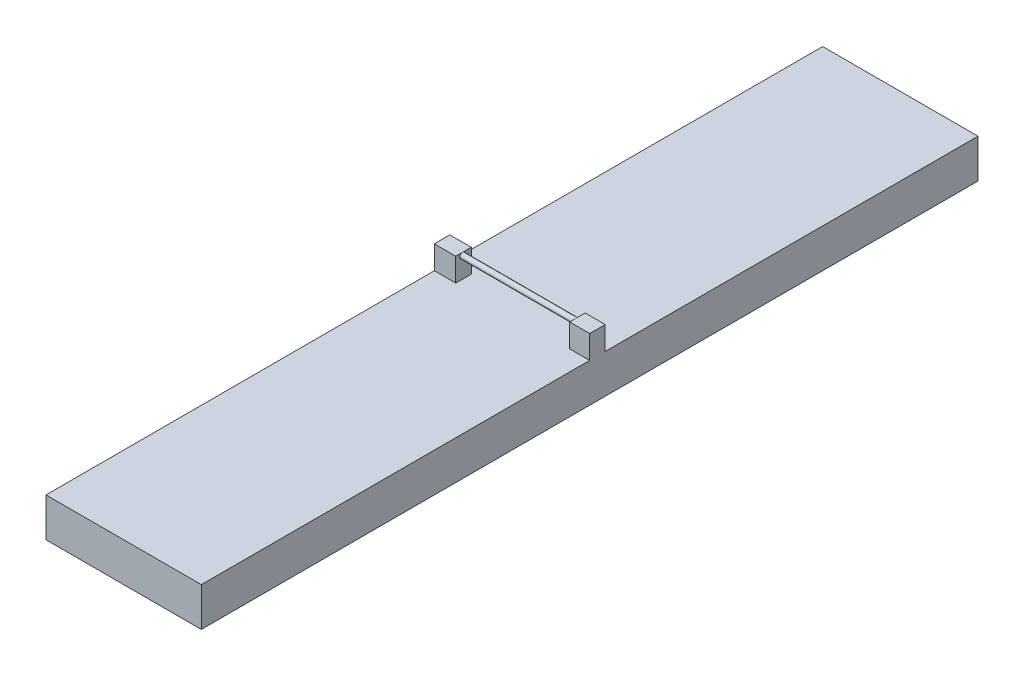
ISO-10303-21;
HEADER;
FILE_DESCRIPTION(('STEP AP214'),'2;1');
FILE_NAME('part.step','',(''),(''),'','','');
FILE_SCHEMA(('AUTOMOTIVE_DESIGN { 1 0 10303 214 1 1 1 1 }'));
ENDSEC;
DATA;
#1=APPLICATION_CONTEXT('core data for automotive mechanical design processes');
#2=APPLICATION_PROTOCOL_DEFINITION('international standard','automotive_design',2000,#1);
#3=PRODUCT_CONTEXT('',#1,'mechanical');
#4=PRODUCT('Part','Part','',(#3));
#5=PRODUCT_RELATED_PRODUCT_CATEGORY('part','',(#4));
#6=PRODUCT_DEFINITION_FORMATION('','',#4);
#7=PRODUCT_DEFINITION_CONTEXT('part definition',#1,'design');
#8=PRODUCT_DEFINITION('design','',#6,#7);
#9=PRODUCT_DEFINITION_SHAPE('','',#8);
#10=(LENGTH_UNIT() NAMED_UNIT(*) SI_UNIT(.MILLI.,.METRE.));
#11=(NAMED_UNIT(*) PLANE_ANGLE_UNIT() SI_UNIT($,.RADIAN.));
#12=(NAMED_UNIT(*) SI_UNIT($,.STERADIAN.) SOLID_ANGLE_UNIT());
#13=UNCERTAINTY_MEASURE_WITH_UNIT(LENGTH_MEASURE(1.E-05),#10,'distance_accuracy_value','');
#14=(GEOMETRIC_REPRESENTATION_CONTEXT(3) GLOBAL_UNCERTAINTY_ASSIGNED_CONTEXT((#13)) GLOBAL_UNIT_ASSIGNED_CONTEXT((#10,
#11,#12)) REPRESENTATION_CONTEXT('',''));
#15=CARTESIAN_POINT('',(0.,0.,0.));
#16=DIRECTION('',(0.,0.,1.));
#17=DIRECTION('',(1.,0.,0.));
#18=AXIS2_PLACEMENT_3D('',#15,#16,#17);
#19=CARTESIAN_POINT('',(-100.,38.6000003153697,-950.));
#20=DIRECTION('',(0.,0.,-1.));
#21=DIRECTION('',(-1.,0.,0.));
#22=AXIS2_PLACEMENT_3D('',#19,#20,#21);
#23=PLANE('',#22);
#24=DIRECTION('',(1.,0.,0.));
#25=VECTOR('',#24,1.);
#26=CARTESIAN_POINT('',(-100.,38.6000003153697,-950.));
#27=LINE('',#26,#25);
#28=CARTESIAN_POINT('',(-100.,38.6000003153697,-950.));
#29=VERTEX_POINT('',#28);
#30=CARTESIAN_POINT('',(100.,38.6000003153697,-950.));
#31=VERTEX_POINT('',#30);
#32=EDGE_CURVE('E35',#29,#31,#27,.T.);
#33=ORIENTED_EDGE('',*,*,#32,.T.);
#34=DIRECTION('',(0.,1.,0.));
#35=VECTOR('',#34,1.);
#36=CARTESIAN_POINT('',(100.,38.6000003153697,-950.));
#37=LINE('',#36,#35);
#38=CARTESIAN_POINT('',(100.,-11.3999996846303,-950.));
#39=VERTEX_POINT('',#38);
#40=EDGE_CURVE('E198',#39,#31,#37,.T.);
#41=ORIENTED_EDGE('',*,*,#40,.F.);
#42=DIRECTION('',(1.,0.,0.));
#43=VECTOR('',#42,1.);
#44=CARTESIAN_POINT('',(-100.,-11.3999996846303,-950.));
#45=LINE('',#44,#43);
#46=CARTESIAN_POINT('',(-100.,-11.3999996846303,-950.));
#47=VERTEX_POINT('',#46);
#48=EDGE_CURVE('E11',#47,#39,#45,.T.);
#49=ORIENTED_EDGE('',*,*,#48,.F.);
#50=DIRECTION('',(0.,1.,0.));
#51=VECTOR('',#50,1.);
#52=CARTESIAN_POINT('',(-100.,38.6000003153697,-950.));
#53=LINE('',#52,#51);
#54=EDGE_CURVE('E211',#47,#29,#53,.T.);
#55=ORIENTED_EDGE('',*,*,#54,.T.);
#56=EDGE_LOOP('',(#33,#41,#49,#55));
#57=FACE_BOUND('',#56,.T.);
#58=ADVANCED_FACE('F32',(#57),#23,.T.);
#59=CARTESIAN_POINT('',(-100.,-11.3999996846303,50.));
#60=DIRECTION('',(0.,-1.,0.));
#61=DIRECTION('',(0.,0.,-1.));
#62=AXIS2_PLACEMENT_3D('',#59,#60,#61);
#63=PLANE('',#62);
#64=ORIENTED_EDGE('',*,*,#48,.T.);
#65=DIRECTION('',(0.,0.,-1.));
#66=VECTOR('',#65,1.);
#67=CARTESIAN_POINT('',(100.,-11.3999996846303,50.));
#68=LINE('',#67,#66);
#69=CARTESIAN_POINT('',(100.,-11.3999996846303,50.));
#70=VERTEX_POINT('',#69);
#71=EDGE_CURVE('E208',#70,#39,#68,.T.);
#72=ORIENTED_EDGE('',*,*,#71,.F.);
#73=DIRECTION('',(1.,0.,0.));
#74=VECTOR('',#73,1.);
#75=CARTESIAN_POINT('',(-100.,-11.3999996846303,50.));
#76=LINE('',#75,#74);
#77=CARTESIAN_POINT('',(-100.,-11.3999996846303,50.));
#78=VERTEX_POINT('',#77);
#79=EDGE_CURVE('E40',#78,#70,#76,.T.);
#80=ORIENTED_EDGE('',*,*,#79,.F.);
#81=DIRECTION('',(0.,0.,-1.));
#82=VECTOR('',#81,1.);
#83=CARTESIAN_POINT('',(-100.,-11.3999996846303,50.));
#84=LINE('',#83,#82);
#85=EDGE_CURVE('E220',#78,#47,#84,.T.);
#86=ORIENTED_EDGE('',*,*,#85,.T.);
#87=EDGE_LOOP('',(#64,#72,#80,#86));
#88=FACE_BOUND('',#87,.T.);
#89=ADVANCED_FACE('F239',(#88),#63,.T.);
#90=CARTESIAN_POINT('',(-100.,38.6000003153697,50.));
#91=DIRECTION('',(0.,0.,1.));
#92=DIRECTION('',(0.,-1.,0.));
#93=AXIS2_PLACEMENT_3D('',#90,#91,#92);
#94=PLANE('',#93);
#95=ORIENTED_EDGE('',*,*,#79,.T.);
#96=DIRECTION('',(0.,-1.,0.));
#97=VECTOR('',#96,1.);
#98=CARTESIAN_POINT('',(100.,38.6000003153697,50.));
#99=LINE('',#98,#97);
#100=CARTESIAN_POINT('',(100.,38.6000003153697,50.));
#101=VERTEX_POINT('',#100);
#102=EDGE_CURVE('E205',#101,#70,#99,.T.);
#103=ORIENTED_EDGE('',*,*,#102,.F.);
#104=DIRECTION('',(1.,0.,0.));
#105=VECTOR('',#104,1.);
#106=CARTESIAN_POINT('',(-100.,38.6000003153697,50.));
#107=LINE('',#106,#105);
#108=CARTESIAN_POINT('',(-100.,38.6000003153697,50.));
#109=VERTEX_POINT('',#108);
#110=EDGE_CURVE('E223',#109,#101,#107,.T.);
#111=ORIENTED_EDGE('',*,*,#110,.F.);
#112=DIRECTION('',(0.,-1.,0.));
#113=VECTOR('',#112,1.);
#114=CARTESIAN_POINT('',(-100.,38.6000003153697,50.));
#115=LINE('',#114,#113);
#116=EDGE_CURVE('E217',#109,#78,#115,.T.);
#117=ORIENTED_EDGE('',*,*,#116,.T.);
#118=EDGE_LOOP('',(#95,#103,#111,#117));
#119=FACE_BOUND('',#118,.T.);
#120=ADVANCED_FACE('F260',(#119),#94,.T.);
#121=CARTESIAN_POINT('',(-100.,38.6000003153697,50.));
#122=DIRECTION('',(0.,1.,0.));
#123=DIRECTION('',(0.,0.,1.));
#124=AXIS2_PLACEMENT_3D('',#121,#122,#123);
#125=PLANE('',#124);
#126=DIRECTION('',(1.,0.,0.));
#127=VECTOR('',#126,1.);
#128=CARTESIAN_POINT('',(0.,38.6000003153697,-470.));
#129=LINE('',#128,#127);
#130=CARTESIAN_POINT('',(74.235459600402,38.6000003153697,-470.));
#131=VERTEX_POINT('',#130);
#132=CARTESIAN_POINT('',(100.,38.6000003153697,-470.));
#133=VERTEX_POINT('',#132);
#134=EDGE_CURVE('E131',#131,#133,#129,.T.);
#135=ORIENTED_EDGE('',*,*,#134,.T.);
#136=DIRECTION('',(0.,0.,1.));
#137=VECTOR('',#136,1.);
#138=CARTESIAN_POINT('',(100.,38.6000003153697,50.));
#139=LINE('',#138,#137);
#140=EDGE_CURVE('E202',#31,#133,#139,.T.);
#141=ORIENTED_EDGE('',*,*,#140,.F.);
#142=ORIENTED_EDGE('',*,*,#32,.F.);
#143=DIRECTION('',(0.,0.,1.));
#144=VECTOR('',#143,1.);
#145=CARTESIAN_POINT('',(-100.,38.6000003153697,50.));
#146=LINE('',#145,#144);
#147=CARTESIAN_POINT('',(-100.,38.6000003153697,-470.));
#148=VERTEX_POINT('',#147);
#149=EDGE_CURVE('E215',#29,#148,#146,.T.);
#150=ORIENTED_EDGE('',*,*,#149,.T.);
#151=DIRECTION('',(1.,0.,0.));
#152=VECTOR('',#151,1.);
#153=CARTESIAN_POINT('',(0.,38.6000003153697,-470.));
#154=LINE('',#153,#152);
#155=CARTESIAN_POINT('',(-72.4508751216035,38.6000003153697,-470.));
#156=VERTEX_POINT('',#155);
#157=EDGE_CURVE('E171',#148,#156,#154,.T.);
#158=ORIENTED_EDGE('',*,*,#157,.T.);
#159=DIRECTION('',(0.,0.,-1.));
#160=VECTOR('',#159,1.);
#161=CARTESIAN_POINT('',(-72.4508751216035,38.6000003153697,0.));
#162=LINE('',#161,#160);
#163=CARTESIAN_POINT('',(-72.4508751216035,38.6000003153697,-450.));
#164=VERTEX_POINT('',#163);
#165=EDGE_CURVE('E183',#164,#156,#162,.T.);
#166=ORIENTED_EDGE('',*,*,#165,.F.);
#167=DIRECTION('',(1.,0.,0.));
#168=VECTOR('',#167,1.);
#169=CARTESIAN_POINT('',(0.,38.6000003153697,-450.));
#170=LINE('',#169,#168);
#171=CARTESIAN_POINT('',(-100.,38.6000003153697,-450.));
#172=VERTEX_POINT('',#171);
#173=EDGE_CURVE('E134',#172,#164,#170,.T.);
#174=ORIENTED_EDGE('',*,*,#173,.F.);
#175=EDGE_CURVE('E214',#172,#109,#146,.T.);
#176=ORIENTED_EDGE('',*,*,#175,.T.);
#177=ORIENTED_EDGE('',*,*,#110,.T.);
#178=CARTESIAN_POINT('',(100.,38.6000003153697,-450.));
#179=VERTEX_POINT('',#178);
#180=EDGE_CURVE('E201',#179,#101,#139,.T.);
#181=ORIENTED_EDGE('',*,*,#180,.F.);
#182=DIRECTION('',(1.,0.,0.));
#183=VECTOR('',#182,1.);
#184=CARTESIAN_POINT('',(0.,38.6000003153697,-450.));
#185=LINE('',#184,#183);
#186=CARTESIAN_POINT('',(74.235459600402,38.6000003153697,-450.));
#187=VERTEX_POINT('',#186);
#188=EDGE_CURVE('E149',#187,#179,#185,.T.);
#189=ORIENTED_EDGE('',*,*,#188,.F.);
#190=DIRECTION('',(0.,0.,1.));
#191=VECTOR('',#190,1.);
#192=CARTESIAN_POINT('',(74.235459600402,38.6000003153697,0.));
#193=LINE('',#192,#191);
#194=EDGE_CURVE('E152',#131,#187,#193,.T.);
#195=ORIENTED_EDGE('',*,*,#194,.F.);
#196=EDGE_LOOP('',(#135,#141,#142,#150,#158,#166,#174,#176,#177,#181,#189,#195));
#197=FACE_BOUND('',#196,.T.);
#198=ADVANCED_FACE('F234',(#197),#125,.T.);
#199=CARTESIAN_POINT('',(-100.,0.,0.));
#200=DIRECTION('',(1.,0.,0.));
#201=DIRECTION('',(0.,0.,-1.));
#202=AXIS2_PLACEMENT_3D('',#199,#200,#201);
#203=PLANE('',#202);
#204=ORIENTED_EDGE('',*,*,#54,.F.);
#205=ORIENTED_EDGE('',*,*,#85,.F.);
#206=ORIENTED_EDGE('',*,*,#116,.F.);
#207=ORIENTED_EDGE('',*,*,#175,.F.);
#208=DIRECTION('',(0.,-1.,0.));
#209=VECTOR('',#208,1.);
#210=CARTESIAN_POINT('',(-100.,68.6000003153697,-450.));
#211=LINE('',#210,#209);
#212=CARTESIAN_POINT('',(-100.,68.6000003153697,-450.));
#213=VERTEX_POINT('',#212);
#214=EDGE_CURVE('E180',#213,#172,#211,.T.);
#215=ORIENTED_EDGE('',*,*,#214,.F.);
#216=DIRECTION('',(0.,0.,1.));
#217=VECTOR('',#216,1.);
#218=CARTESIAN_POINT('',(-100.,68.6000003153697,0.));
#219=LINE('',#218,#217);
#220=CARTESIAN_POINT('',(-100.,68.6000003153697,-470.));
#221=VERTEX_POINT('',#220);
#222=EDGE_CURVE('E178',#221,#213,#219,.T.);
#223=ORIENTED_EDGE('',*,*,#222,.F.);
#224=DIRECTION('',(0.,-1.,0.));
#225=VECTOR('',#224,1.);
#226=CARTESIAN_POINT('',(-100.,68.6000003153697,-470.));
#227=LINE('',#226,#225);
#228=EDGE_CURVE('E189',#221,#148,#227,.T.);
#229=ORIENTED_EDGE('',*,*,#228,.T.);
#230=ORIENTED_EDGE('',*,*,#149,.F.);
#231=EDGE_LOOP('',(#204,#205,#206,#207,#215,#223,#229,#230));
#232=FACE_BOUND('',#231,.T.);
#233=ADVANCED_FACE('F242',(#232),#203,.F.);
#234=CARTESIAN_POINT('',(100.,0.,0.));
#235=DIRECTION('',(1.,0.,0.));
#236=DIRECTION('',(0.,0.,-1.));
#237=AXIS2_PLACEMENT_3D('',#234,#235,#236);
#238=PLANE('',#237);
#239=ORIENTED_EDGE('',*,*,#40,.T.);
#240=ORIENTED_EDGE('',*,*,#140,.T.);
#241=DIRECTION('',(0.,-1.,0.));
#242=VECTOR('',#241,1.);
#243=CARTESIAN_POINT('',(100.,68.6000003153697,-470.));
#244=LINE('',#243,#242);
#245=CARTESIAN_POINT('',(100.,68.6000003153697,-470.));
#246=VERTEX_POINT('',#245);
#247=EDGE_CURVE('E159',#246,#133,#244,.T.);
#248=ORIENTED_EDGE('',*,*,#247,.F.);
#249=DIRECTION('',(0.,0.,-1.));
#250=VECTOR('',#249,1.);
#251=CARTESIAN_POINT('',(100.,68.6000003153697,0.));
#252=LINE('',#251,#250);
#253=CARTESIAN_POINT('',(100.,68.6000003153697,-450.));
#254=VERTEX_POINT('',#253);
#255=EDGE_CURVE('E147',#254,#246,#252,.T.);
#256=ORIENTED_EDGE('',*,*,#255,.F.);
#257=DIRECTION('',(0.,-1.,0.));
#258=VECTOR('',#257,1.);
#259=CARTESIAN_POINT('',(100.,68.6000003153697,-450.));
#260=LINE('',#259,#258);
#261=EDGE_CURVE('E163',#254,#179,#260,.T.);
#262=ORIENTED_EDGE('',*,*,#261,.T.);
#263=ORIENTED_EDGE('',*,*,#180,.T.);
#264=ORIENTED_EDGE('',*,*,#102,.T.);
#265=ORIENTED_EDGE('',*,*,#71,.T.);
#266=EDGE_LOOP('',(#239,#240,#248,#256,#262,#263,#264,#265));
#267=FACE_BOUND('',#266,.T.);
#268=ADVANCED_FACE('F236',(#267),#238,.T.);
#269=CARTESIAN_POINT('',(0.,68.6000003153697,-450.));
#270=DIRECTION('',(0.,0.,-1.));
#271=DIRECTION('',(0.,1.,0.));
#272=AXIS2_PLACEMENT_3D('',#269,#270,#271);
#273=PLANE('',#272);
#274=ORIENTED_EDGE('',*,*,#173,.T.);
#275=DIRECTION('',(0.,-1.,0.));
#276=VECTOR('',#275,1.);
#277=CARTESIAN_POINT('',(-72.4508751216035,68.6000003153697,-450.));
#278=LINE('',#277,#276);
#279=CARTESIAN_POINT('',(-72.4508751216035,68.6000003153697,-450.));
#280=VERTEX_POINT('',#279);
#281=EDGE_CURVE('E195',#280,#164,#278,.T.);
#282=ORIENTED_EDGE('',*,*,#281,.F.);
#283=DIRECTION('',(1.,0.,0.));
#284=VECTOR('',#283,1.);
#285=CARTESIAN_POINT('',(0.,68.6000003153697,-450.));
#286=LINE('',#285,#284);
#287=EDGE_CURVE('E167',#213,#280,#286,.T.);
#288=ORIENTED_EDGE('',*,*,#287,.F.);
#289=ORIENTED_EDGE('',*,*,#214,.T.);
#290=EDGE_LOOP('',(#274,#282,#288,#289));
#291=FACE_BOUND('',#290,.T.);
#292=ADVANCED_FACE('F256',(#291),#273,.F.);
#293=CARTESIAN_POINT('',(-72.4508751216035,68.6000003153697,0.));
#294=DIRECTION('',(-1.,0.,0.));
#295=DIRECTION('',(0.,0.,1.));
#296=AXIS2_PLACEMENT_3D('',#293,#294,#295);
#297=PLANE('',#296);
#298=DIRECTION('',(0.,0.,-1.));
#299=VECTOR('',#298,1.);
#300=CARTESIAN_POINT('',(-72.4508751216035,68.6000003153697,0.));
#301=LINE('',#300,#299);
#302=CARTESIAN_POINT('',(-72.4508751216035,68.6000003153697,-458.61552839436));
#303=VERTEX_POINT('',#302);
#304=CARTESIAN_POINT('',(-72.4508751216035,68.6000003153697,-470.));
#305=VERTEX_POINT('',#304);
#306=EDGE_CURVE('E170',#303,#305,#301,.T.);
#307=ORIENTED_EDGE('',*,*,#306,.F.);
#308=CARTESIAN_POINT('',(-72.4508751216035,65.1518689275737,-458.61552839436));
#309=DIRECTION('',(-1.,0.,0.));
#310=DIRECTION('',(0.,0.,1.));
#311=AXIS2_PLACEMENT_3D('',#308,#309,#310);
#312=CIRCLE('',#311,3.44813138779607);
#313=EDGE_CURVE('E46',#303,#303,#312,.T.);
#314=ORIENTED_EDGE('',*,*,#313,.T.);
#315=EDGE_CURVE('E172',#280,#303,#301,.T.);
#316=ORIENTED_EDGE('',*,*,#315,.F.);
#317=ORIENTED_EDGE('',*,*,#281,.T.);
#318=ORIENTED_EDGE('',*,*,#165,.T.);
#319=DIRECTION('',(0.,-1.,0.));
#320=VECTOR('',#319,1.);
#321=CARTESIAN_POINT('',(-72.4508751216035,68.6000003153697,-470.));
#322=LINE('',#321,#320);
#323=EDGE_CURVE('E192',#305,#156,#322,.T.);
#324=ORIENTED_EDGE('',*,*,#323,.F.);
#325=EDGE_LOOP('',(#307,#314,#316,#317,#318,#324));
#326=FACE_BOUND('',#325,.T.);
#327=ADVANCED_FACE('F252',(#326),#297,.F.);
#328=CARTESIAN_POINT('',(0.,68.6000003153697,-470.));
#329=DIRECTION('',(0.,0.,-1.));
#330=DIRECTION('',(0.,1.,0.));
#331=AXIS2_PLACEMENT_3D('',#328,#329,#330);
#332=PLANE('',#331);
#333=ORIENTED_EDGE('',*,*,#157,.F.);
#334=ORIENTED_EDGE('',*,*,#228,.F.);
#335=DIRECTION('',(1.,0.,0.));
#336=VECTOR('',#335,1.);
#337=CARTESIAN_POINT('',(0.,68.6000003153697,-470.));
#338=LINE('',#337,#336);
#339=EDGE_CURVE('E175',#221,#305,#338,.T.);
#340=ORIENTED_EDGE('',*,*,#339,.T.);
#341=ORIENTED_EDGE('',*,*,#323,.T.);
#342=EDGE_LOOP('',(#333,#334,#340,#341));
#343=FACE_BOUND('',#342,.T.);
#344=ADVANCED_FACE('F248',(#343),#332,.T.);
#345=CARTESIAN_POINT('',(0.,68.6000003153697,0.));
#346=DIRECTION('',(0.,1.,0.));
#347=DIRECTION('',(0.,0.,1.));
#348=AXIS2_PLACEMENT_3D('',#345,#346,#347);
#349=PLANE('',#348);
#350=ORIENTED_EDGE('',*,*,#315,.T.);
#351=ORIENTED_EDGE('',*,*,#306,.T.);
#352=ORIENTED_EDGE('',*,*,#339,.F.);
#353=ORIENTED_EDGE('',*,*,#222,.T.);
#354=ORIENTED_EDGE('',*,*,#287,.T.);
#355=EDGE_LOOP('',(#350,#351,#352,#353,#354));
#356=FACE_BOUND('',#355,.T.);
#357=ADVANCED_FACE('F324',(#356),#349,.T.);
#358=CARTESIAN_POINT('',(0.,68.6000003153697,-470.));
#359=DIRECTION('',(0.,0.,-1.));
#360=DIRECTION('',(0.,1.,0.));
#361=AXIS2_PLACEMENT_3D('',#358,#359,#360);
#362=PLANE('',#361);
#363=ORIENTED_EDGE('',*,*,#134,.F.);
#364=DIRECTION('',(0.,-1.,0.));
#365=VECTOR('',#364,1.);
#366=CARTESIAN_POINT('',(74.235459600402,68.6000003153697,-470.));
#367=LINE('',#366,#365);
#368=CARTESIAN_POINT('',(74.235459600402,68.6000003153697,-470.));
#369=VERTEX_POINT('',#368);
#370=EDGE_CURVE('E125',#369,#131,#367,.T.);
#371=ORIENTED_EDGE('',*,*,#370,.F.);
#372=DIRECTION('',(1.,0.,0.));
#373=VECTOR('',#372,1.);
#374=CARTESIAN_POINT('',(0.,68.6000003153697,-470.));
#375=LINE('',#374,#373);
#376=EDGE_CURVE('E129',#369,#246,#375,.T.);
#377=ORIENTED_EDGE('',*,*,#376,.T.);
#378=ORIENTED_EDGE('',*,*,#247,.T.);
#379=EDGE_LOOP('',(#363,#371,#377,#378));
#380=FACE_BOUND('',#379,.T.);
#381=ADVANCED_FACE('F127',(#380),#362,.T.);
#382=CARTESIAN_POINT('',(74.235459600402,68.6000003153697,0.));
#383=DIRECTION('',(1.,0.,0.));
#384=DIRECTION('',(0.,0.,-1.));
#385=AXIS2_PLACEMENT_3D('',#382,#383,#384);
#386=PLANE('',#385);
#387=DIRECTION('',(0.,0.,1.));
#388=VECTOR('',#387,1.);
#389=CARTESIAN_POINT('',(74.235459600402,68.6000003153697,0.));
#390=LINE('',#389,#388);
#391=CARTESIAN_POINT('',(74.235459600402,68.6000003153697,-458.61552839436));
#392=VERTEX_POINT('',#391);
#393=CARTESIAN_POINT('',(74.235459600402,68.6000003153697,-450.));
#394=VERTEX_POINT('',#393);
#395=EDGE_CURVE('E143',#392,#394,#390,.T.);
#396=ORIENTED_EDGE('',*,*,#395,.F.);
#397=CARTESIAN_POINT('',(74.235459600402,65.1518689275737,-458.61552839436));
#398=DIRECTION('',(1.,0.,0.));
#399=DIRECTION('',(0.,0.,-1.));
#400=AXIS2_PLACEMENT_3D('',#397,#398,#399);
#401=CIRCLE('',#400,3.44813138779607);
#402=EDGE_CURVE('E51',#392,#392,#401,.T.);
#403=ORIENTED_EDGE('',*,*,#402,.T.);
#404=EDGE_CURVE('E138',#369,#392,#390,.T.);
#405=ORIENTED_EDGE('',*,*,#404,.F.);
#406=ORIENTED_EDGE('',*,*,#370,.T.);
#407=ORIENTED_EDGE('',*,*,#194,.T.);
#408=DIRECTION('',(0.,-1.,0.));
#409=VECTOR('',#408,1.);
#410=CARTESIAN_POINT('',(74.235459600402,68.6000003153697,-450.));
#411=LINE('',#410,#409);
#412=EDGE_CURVE('E135',#394,#187,#411,.T.);
#413=ORIENTED_EDGE('',*,*,#412,.F.);
#414=EDGE_LOOP('',(#396,#403,#405,#406,#407,#413));
#415=FACE_BOUND('',#414,.T.);
#416=ADVANCED_FACE('F140',(#415),#386,.F.);
#417=CARTESIAN_POINT('',(0.,68.6000003153697,-450.));
#418=DIRECTION('',(0.,0.,-1.));
#419=DIRECTION('',(0.,1.,0.));
#420=AXIS2_PLACEMENT_3D('',#417,#418,#419);
#421=PLANE('',#420);
#422=ORIENTED_EDGE('',*,*,#188,.T.);
#423=ORIENTED_EDGE('',*,*,#261,.F.);
#424=DIRECTION('',(1.,0.,0.));
#425=VECTOR('',#424,1.);
#426=CARTESIAN_POINT('',(0.,68.6000003153697,-450.));
#427=LINE('',#426,#425);
#428=EDGE_CURVE('E142',#394,#254,#427,.T.);
#429=ORIENTED_EDGE('',*,*,#428,.F.);
#430=ORIENTED_EDGE('',*,*,#412,.T.);
#431=EDGE_LOOP('',(#422,#423,#429,#430));
#432=FACE_BOUND('',#431,.T.);
#433=ADVANCED_FACE('F343',(#432),#421,.F.);
#434=CARTESIAN_POINT('',(0.,68.6000003153697,0.));
#435=DIRECTION('',(0.,1.,0.));
#436=DIRECTION('',(0.,0.,1.));
#437=AXIS2_PLACEMENT_3D('',#434,#435,#436);
#438=PLANE('',#437);
#439=ORIENTED_EDGE('',*,*,#376,.F.);
#440=ORIENTED_EDGE('',*,*,#404,.T.);
#441=ORIENTED_EDGE('',*,*,#395,.T.);
#442=ORIENTED_EDGE('',*,*,#428,.T.);
#443=ORIENTED_EDGE('',*,*,#255,.T.);
#444=EDGE_LOOP('',(#439,#440,#441,#442,#443));
#445=FACE_BOUND('',#444,.T.);
#446=ADVANCED_FACE('F145',(#445),#438,.T.);
#447=CARTESIAN_POINT('',(-87.4508751216035,65.1518689275737,-458.61552839436));
#448=DIRECTION('',(1.,0.,0.));
#449=DIRECTION('',(0.,0.,-1.));
#450=AXIS2_PLACEMENT_3D('',#447,#448,#449);
#451=CYLINDRICAL_SURFACE('',#450,3.44813138779607);
#452=ORIENTED_EDGE('',*,*,#402,.F.);
#453=EDGE_LOOP('',(#452));
#454=FACE_BOUND('',#453,.T.);
#455=ORIENTED_EDGE('',*,*,#313,.F.);
#456=EDGE_LOOP('',(#455));
#457=FACE_BOUND('',#456,.T.);
#458=ADVANCED_FACE('F377',(#454,#457),#451,.T.);
#459=CLOSED_SHELL('',(#58,#89,#120,#198,#233,#268,#292,#327,#344,#357,#381,#416,#433,#446,#458));
#460=MANIFOLD_SOLID_BREP('B2',#459);
#461=ADVANCED_BREP_SHAPE_REPRESENTATION('',(#18,#460),#14);
#462=SHAPE_DEFINITION_REPRESENTATION(#9,#461);
ENDSEC;
END-ISO-10303-21;
